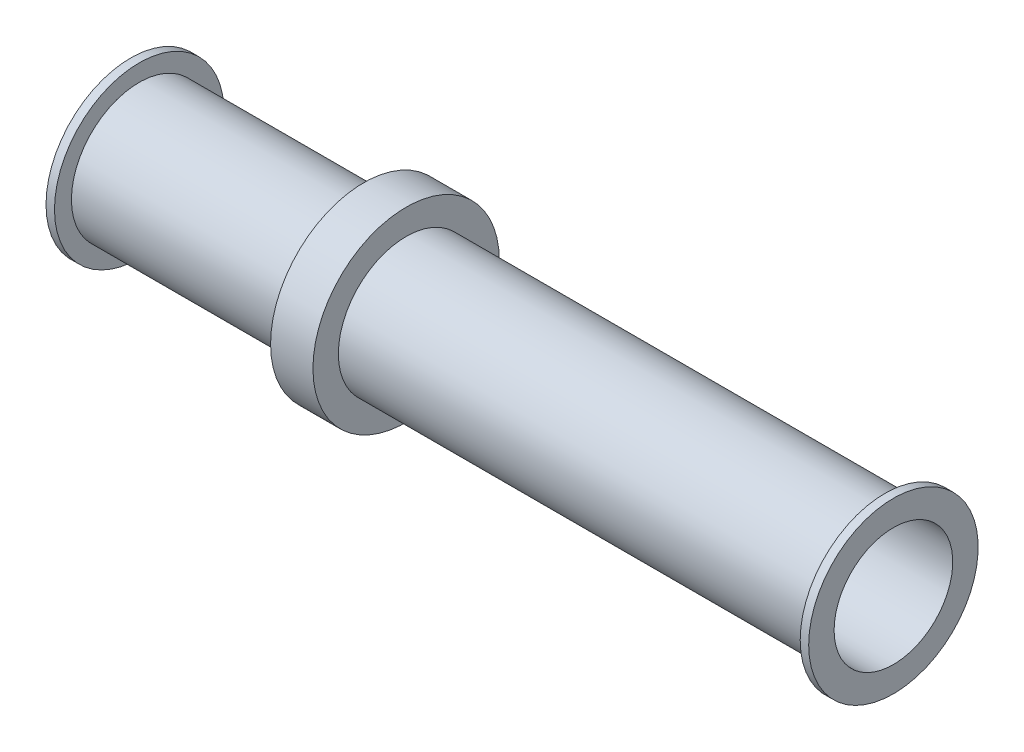
ISO-10303-21;
HEADER;
FILE_DESCRIPTION(('STEP AP214'),'2;1');
FILE_NAME('part.step','',(''),(''),'','','');
FILE_SCHEMA(('AUTOMOTIVE_DESIGN { 1 0 10303 214 1 1 1 1 }'));
ENDSEC;
DATA;
#1=APPLICATION_CONTEXT('core data for automotive mechanical design processes');
#2=APPLICATION_PROTOCOL_DEFINITION('international standard','automotive_design',2000,#1);
#3=PRODUCT_CONTEXT('',#1,'mechanical');
#4=PRODUCT('Part','Part','',(#3));
#5=PRODUCT_RELATED_PRODUCT_CATEGORY('part','',(#4));
#6=PRODUCT_DEFINITION_FORMATION('','',#4);
#7=PRODUCT_DEFINITION_CONTEXT('part definition',#1,'design');
#8=PRODUCT_DEFINITION('design','',#6,#7);
#9=PRODUCT_DEFINITION_SHAPE('','',#8);
#10=(LENGTH_UNIT() NAMED_UNIT(*) SI_UNIT(.MILLI.,.METRE.));
#11=(NAMED_UNIT(*) PLANE_ANGLE_UNIT() SI_UNIT($,.RADIAN.));
#12=(NAMED_UNIT(*) SI_UNIT($,.STERADIAN.) SOLID_ANGLE_UNIT());
#13=UNCERTAINTY_MEASURE_WITH_UNIT(LENGTH_MEASURE(1.E-05),#10,'distance_accuracy_value','');
#14=(GEOMETRIC_REPRESENTATION_CONTEXT(3) GLOBAL_UNCERTAINTY_ASSIGNED_CONTEXT((#13)) GLOBAL_UNIT_ASSIGNED_CONTEXT((#10,
#11,#12)) REPRESENTATION_CONTEXT('',''));
#15=CARTESIAN_POINT('',(0.,0.,0.));
#16=DIRECTION('',(0.,0.,1.));
#17=DIRECTION('',(1.,0.,0.));
#18=AXIS2_PLACEMENT_3D('',#15,#16,#17);
#19=CARTESIAN_POINT('',(0.,0.,0.));
#20=DIRECTION('',(-1.,0.,0.));
#21=DIRECTION('',(0.,0.,1.));
#22=AXIS2_PLACEMENT_3D('',#19,#20,#21);
#23=CYLINDRICAL_SURFACE('',#22,2.54);
#24=CARTESIAN_POINT('',(0.,0.,0.));
#25=DIRECTION('',(-1.,0.,0.));
#26=DIRECTION('',(0.,0.,1.));
#27=AXIS2_PLACEMENT_3D('',#24,#25,#26);
#28=CIRCLE('',#27,2.54);
#29=CARTESIAN_POINT('',(0.,0.,2.54));
#30=VERTEX_POINT('',#29);
#31=EDGE_CURVE('E70',#30,#30,#28,.T.);
#32=ORIENTED_EDGE('',*,*,#31,.F.);
#33=EDGE_LOOP('',(#32));
#34=FACE_BOUND('',#33,.T.);
#35=CARTESIAN_POINT('',(0.254,0.,0.));
#36=DIRECTION('',(-1.,0.,0.));
#37=DIRECTION('',(0.,0.,1.));
#38=AXIS2_PLACEMENT_3D('',#35,#36,#37);
#39=CIRCLE('',#38,2.54);
#40=CARTESIAN_POINT('',(0.254,0.,2.54));
#41=VERTEX_POINT('',#40);
#42=EDGE_CURVE('E10',#41,#41,#39,.T.);
#43=ORIENTED_EDGE('',*,*,#42,.T.);
#44=EDGE_LOOP('',(#43));
#45=FACE_BOUND('',#44,.T.);
#46=ADVANCED_FACE('F30',(#34,#45),#23,.T.);
#47=CARTESIAN_POINT('',(0.254,2.54,0.));
#48=DIRECTION('',(-1.,0.,0.));
#49=DIRECTION('',(0.,0.,1.));
#50=AXIS2_PLACEMENT_3D('',#47,#48,#49);
#51=PLANE('',#50);
#52=ORIENTED_EDGE('',*,*,#42,.F.);
#53=EDGE_LOOP('',(#52));
#54=FACE_BOUND('',#53,.T.);
#55=CARTESIAN_POINT('',(0.254,0.,0.));
#56=DIRECTION('',(-1.,0.,0.));
#57=DIRECTION('',(0.,0.,1.));
#58=AXIS2_PLACEMENT_3D('',#55,#56,#57);
#59=CIRCLE('',#58,2.032);
#60=CARTESIAN_POINT('',(0.254,0.,2.032));
#61=VERTEX_POINT('',#60);
#62=EDGE_CURVE('E36',#61,#61,#59,.T.);
#63=ORIENTED_EDGE('',*,*,#62,.T.);
#64=EDGE_LOOP('',(#63));
#65=FACE_BOUND('',#64,.T.);
#66=ADVANCED_FACE('F77',(#54,#65),#51,.F.);
#67=CARTESIAN_POINT('',(0.,0.,0.));
#68=DIRECTION('',(-1.,0.,0.));
#69=DIRECTION('',(0.,0.,1.));
#70=AXIS2_PLACEMENT_3D('',#67,#68,#69);
#71=CYLINDRICAL_SURFACE('',#70,2.032);
#72=ORIENTED_EDGE('',*,*,#62,.F.);
#73=EDGE_LOOP('',(#72));
#74=FACE_BOUND('',#73,.T.);
#75=CARTESIAN_POINT('',(6.985,0.,0.));
#76=DIRECTION('',(-1.,0.,0.));
#77=DIRECTION('',(0.,0.,1.));
#78=AXIS2_PLACEMENT_3D('',#75,#76,#77);
#79=CIRCLE('',#78,2.032);
#80=CARTESIAN_POINT('',(6.985,0.,2.032));
#81=VERTEX_POINT('',#80);
#82=EDGE_CURVE('E40',#81,#81,#79,.T.);
#83=ORIENTED_EDGE('',*,*,#82,.T.);
#84=EDGE_LOOP('',(#83));
#85=FACE_BOUND('',#84,.T.);
#86=ADVANCED_FACE('F81',(#74,#85),#71,.T.);
#87=CARTESIAN_POINT('',(6.985,2.794,0.));
#88=DIRECTION('',(1.,0.,0.));
#89=DIRECTION('',(0.,0.,-1.));
#90=AXIS2_PLACEMENT_3D('',#87,#88,#89);
#91=PLANE('',#90);
#92=ORIENTED_EDGE('',*,*,#82,.F.);
#93=EDGE_LOOP('',(#92));
#94=FACE_BOUND('',#93,.T.);
#95=CARTESIAN_POINT('',(6.985,0.,0.));
#96=DIRECTION('',(-1.,0.,0.));
#97=DIRECTION('',(0.,0.,1.));
#98=AXIS2_PLACEMENT_3D('',#95,#96,#97);
#99=CIRCLE('',#98,2.794);
#100=CARTESIAN_POINT('',(6.985,0.,2.794));
#101=VERTEX_POINT('',#100);
#102=EDGE_CURVE('E44',#101,#101,#99,.T.);
#103=ORIENTED_EDGE('',*,*,#102,.T.);
#104=EDGE_LOOP('',(#103));
#105=FACE_BOUND('',#104,.T.);
#106=ADVANCED_FACE('F86',(#94,#105),#91,.F.);
#107=CARTESIAN_POINT('',(0.,0.,0.));
#108=DIRECTION('',(-1.,0.,0.));
#109=DIRECTION('',(0.,0.,1.));
#110=AXIS2_PLACEMENT_3D('',#107,#108,#109);
#111=CYLINDRICAL_SURFACE('',#110,2.794);
#112=ORIENTED_EDGE('',*,*,#102,.F.);
#113=EDGE_LOOP('',(#112));
#114=FACE_BOUND('',#113,.T.);
#115=CARTESIAN_POINT('',(8.255,0.,0.));
#116=DIRECTION('',(-1.,0.,0.));
#117=DIRECTION('',(0.,0.,1.));
#118=AXIS2_PLACEMENT_3D('',#115,#116,#117);
#119=CIRCLE('',#118,2.794);
#120=CARTESIAN_POINT('',(8.255,0.,2.794));
#121=VERTEX_POINT('',#120);
#122=EDGE_CURVE('E49',#121,#121,#119,.T.);
#123=ORIENTED_EDGE('',*,*,#122,.T.);
#124=EDGE_LOOP('',(#123));
#125=FACE_BOUND('',#124,.T.);
#126=ADVANCED_FACE('F92',(#114,#125),#111,.T.);
#127=CARTESIAN_POINT('',(8.255,2.032,0.));
#128=DIRECTION('',(-1.,0.,0.));
#129=DIRECTION('',(0.,0.,1.));
#130=AXIS2_PLACEMENT_3D('',#127,#128,#129);
#131=PLANE('',#130);
#132=ORIENTED_EDGE('',*,*,#122,.F.);
#133=EDGE_LOOP('',(#132));
#134=FACE_BOUND('',#133,.T.);
#135=CARTESIAN_POINT('',(8.255,0.,0.));
#136=DIRECTION('',(-1.,0.,0.));
#137=DIRECTION('',(0.,0.,1.));
#138=AXIS2_PLACEMENT_3D('',#135,#136,#137);
#139=CIRCLE('',#138,2.032);
#140=CARTESIAN_POINT('',(8.255,0.,2.032));
#141=VERTEX_POINT('',#140);
#142=EDGE_CURVE('E52',#141,#141,#139,.T.);
#143=ORIENTED_EDGE('',*,*,#142,.T.);
#144=EDGE_LOOP('',(#143));
#145=FACE_BOUND('',#144,.T.);
#146=ADVANCED_FACE('F96',(#134,#145),#131,.F.);
#147=CARTESIAN_POINT('',(0.,0.,0.));
#148=DIRECTION('',(-1.,0.,0.));
#149=DIRECTION('',(0.,0.,1.));
#150=AXIS2_PLACEMENT_3D('',#147,#148,#149);
#151=CYLINDRICAL_SURFACE('',#150,2.032);
#152=ORIENTED_EDGE('',*,*,#142,.F.);
#153=EDGE_LOOP('',(#152));
#154=FACE_BOUND('',#153,.T.);
#155=CARTESIAN_POINT('',(22.606,0.,0.));
#156=DIRECTION('',(-1.,0.,0.));
#157=DIRECTION('',(0.,0.,1.));
#158=AXIS2_PLACEMENT_3D('',#155,#156,#157);
#159=CIRCLE('',#158,2.032);
#160=CARTESIAN_POINT('',(22.606,0.,2.032));
#161=VERTEX_POINT('',#160);
#162=EDGE_CURVE('E55',#161,#161,#159,.T.);
#163=ORIENTED_EDGE('',*,*,#162,.T.);
#164=EDGE_LOOP('',(#163));
#165=FACE_BOUND('',#164,.T.);
#166=ADVANCED_FACE('F100',(#154,#165),#151,.T.);
#167=CARTESIAN_POINT('',(22.606,2.032,0.));
#168=DIRECTION('',(1.,0.,0.));
#169=DIRECTION('',(0.,0.,-1.));
#170=AXIS2_PLACEMENT_3D('',#167,#168,#169);
#171=PLANE('',#170);
#172=ORIENTED_EDGE('',*,*,#162,.F.);
#173=EDGE_LOOP('',(#172));
#174=FACE_BOUND('',#173,.T.);
#175=CARTESIAN_POINT('',(22.606,0.,0.));
#176=DIRECTION('',(-1.,0.,0.));
#177=DIRECTION('',(0.,0.,1.));
#178=AXIS2_PLACEMENT_3D('',#175,#176,#177);
#179=CIRCLE('',#178,2.54);
#180=CARTESIAN_POINT('',(22.606,0.,2.54));
#181=VERTEX_POINT('',#180);
#182=EDGE_CURVE('E58',#181,#181,#179,.T.);
#183=ORIENTED_EDGE('',*,*,#182,.T.);
#184=EDGE_LOOP('',(#183));
#185=FACE_BOUND('',#184,.T.);
#186=ADVANCED_FACE('F104',(#174,#185),#171,.F.);
#187=CARTESIAN_POINT('',(0.,0.,0.));
#188=DIRECTION('',(-1.,0.,0.));
#189=DIRECTION('',(0.,0.,1.));
#190=AXIS2_PLACEMENT_3D('',#187,#188,#189);
#191=CYLINDRICAL_SURFACE('',#190,2.54);
#192=ORIENTED_EDGE('',*,*,#182,.F.);
#193=EDGE_LOOP('',(#192));
#194=FACE_BOUND('',#193,.T.);
#195=CARTESIAN_POINT('',(22.86,0.,0.));
#196=DIRECTION('',(-1.,0.,0.));
#197=DIRECTION('',(0.,0.,1.));
#198=AXIS2_PLACEMENT_3D('',#195,#196,#197);
#199=CIRCLE('',#198,2.54);
#200=CARTESIAN_POINT('',(22.86,0.,2.54));
#201=VERTEX_POINT('',#200);
#202=EDGE_CURVE('E61',#201,#201,#199,.T.);
#203=ORIENTED_EDGE('',*,*,#202,.T.);
#204=EDGE_LOOP('',(#203));
#205=FACE_BOUND('',#204,.T.);
#206=ADVANCED_FACE('F108',(#194,#205),#191,.T.);
#207=CARTESIAN_POINT('',(22.86,2.54,0.));
#208=DIRECTION('',(-1.,0.,0.));
#209=DIRECTION('',(0.,0.,1.));
#210=AXIS2_PLACEMENT_3D('',#207,#208,#209);
#211=PLANE('',#210);
#212=ORIENTED_EDGE('',*,*,#202,.F.);
#213=EDGE_LOOP('',(#212));
#214=FACE_BOUND('',#213,.T.);
#215=CARTESIAN_POINT('',(22.86,0.,0.));
#216=DIRECTION('',(-1.,0.,0.));
#217=DIRECTION('',(0.,0.,1.));
#218=AXIS2_PLACEMENT_3D('',#215,#216,#217);
#219=CIRCLE('',#218,1.778);
#220=CARTESIAN_POINT('',(22.86,0.,1.778));
#221=VERTEX_POINT('',#220);
#222=EDGE_CURVE('E64',#221,#221,#219,.T.);
#223=ORIENTED_EDGE('',*,*,#222,.T.);
#224=EDGE_LOOP('',(#223));
#225=FACE_BOUND('',#224,.T.);
#226=ADVANCED_FACE('F112',(#214,#225),#211,.F.);
#227=CARTESIAN_POINT('',(0.,0.,0.));
#228=DIRECTION('',(-1.,0.,0.));
#229=DIRECTION('',(0.,0.,1.));
#230=AXIS2_PLACEMENT_3D('',#227,#228,#229);
#231=CYLINDRICAL_SURFACE('',#230,1.778);
#232=ORIENTED_EDGE('',*,*,#222,.F.);
#233=EDGE_LOOP('',(#232));
#234=FACE_BOUND('',#233,.T.);
#235=CARTESIAN_POINT('',(0.,0.,0.));
#236=DIRECTION('',(-1.,0.,0.));
#237=DIRECTION('',(0.,0.,1.));
#238=AXIS2_PLACEMENT_3D('',#235,#236,#237);
#239=CIRCLE('',#238,1.778);
#240=CARTESIAN_POINT('',(0.,0.,1.778));
#241=VERTEX_POINT('',#240);
#242=EDGE_CURVE('E67',#241,#241,#239,.T.);
#243=ORIENTED_EDGE('',*,*,#242,.T.);
#244=EDGE_LOOP('',(#243));
#245=FACE_BOUND('',#244,.T.);
#246=ADVANCED_FACE('F116',(#234,#245),#231,.F.);
#247=CARTESIAN_POINT('',(0.,1.778,0.));
#248=DIRECTION('',(1.,0.,0.));
#249=DIRECTION('',(0.,0.,-1.));
#250=AXIS2_PLACEMENT_3D('',#247,#248,#249);
#251=PLANE('',#250);
#252=ORIENTED_EDGE('',*,*,#242,.F.);
#253=EDGE_LOOP('',(#252));
#254=FACE_BOUND('',#253,.T.);
#255=ORIENTED_EDGE('',*,*,#31,.T.);
#256=EDGE_LOOP('',(#255));
#257=FACE_BOUND('',#256,.T.);
#258=ADVANCED_FACE('F74',(#254,#257),#251,.F.);
#259=CLOSED_SHELL('',(#46,#66,#86,#106,#126,#146,#166,#186,#206,#226,#246,#258));
#260=MANIFOLD_SOLID_BREP('B2',#259);
#261=ADVANCED_BREP_SHAPE_REPRESENTATION('',(#18,#260),#14);
#262=SHAPE_DEFINITION_REPRESENTATION(#9,#261);
ENDSEC;
END-ISO-10303-21;
